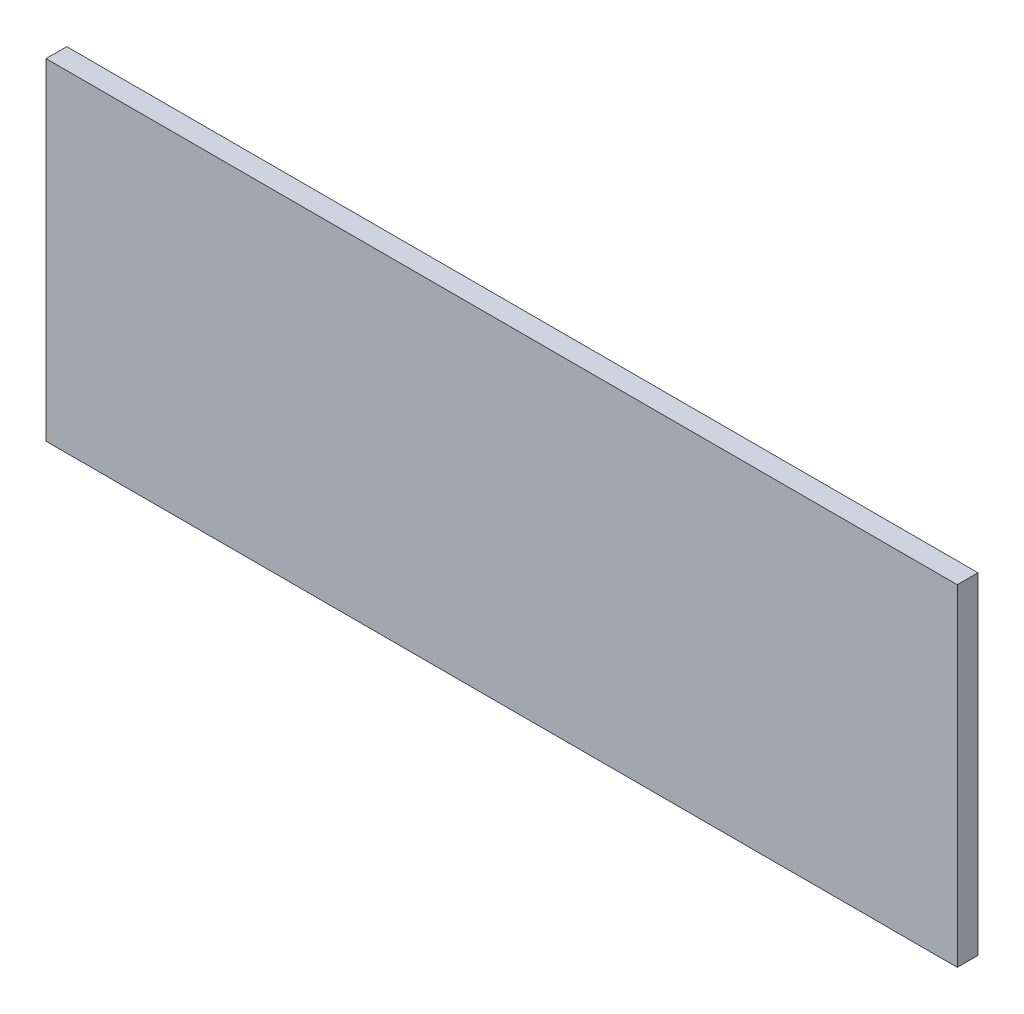
ISO-10303-21;
HEADER;
FILE_DESCRIPTION(('STEP AP214'),'2;1');
FILE_NAME('part.step','',(''),(''),'','','');
FILE_SCHEMA(('AUTOMOTIVE_DESIGN { 1 0 10303 214 1 1 1 1 }'));
ENDSEC;
DATA;
#1=APPLICATION_CONTEXT('core data for automotive mechanical design processes');
#2=APPLICATION_PROTOCOL_DEFINITION('international standard','automotive_design',2000,#1);
#3=PRODUCT_CONTEXT('',#1,'mechanical');
#4=PRODUCT('Part','Part','',(#3));
#5=PRODUCT_RELATED_PRODUCT_CATEGORY('part','',(#4));
#6=PRODUCT_DEFINITION_FORMATION('','',#4);
#7=PRODUCT_DEFINITION_CONTEXT('part definition',#1,'design');
#8=PRODUCT_DEFINITION('design','',#6,#7);
#9=PRODUCT_DEFINITION_SHAPE('','',#8);
#10=(LENGTH_UNIT() NAMED_UNIT(*) SI_UNIT(.MILLI.,.METRE.));
#11=(NAMED_UNIT(*) PLANE_ANGLE_UNIT() SI_UNIT($,.RADIAN.));
#12=(NAMED_UNIT(*) SI_UNIT($,.STERADIAN.) SOLID_ANGLE_UNIT());
#13=UNCERTAINTY_MEASURE_WITH_UNIT(LENGTH_MEASURE(1.E-05),#10,'distance_accuracy_value','');
#14=(GEOMETRIC_REPRESENTATION_CONTEXT(3) GLOBAL_UNCERTAINTY_ASSIGNED_CONTEXT((#13)) GLOBAL_UNIT_ASSIGNED_CONTEXT((#10,
#11,#12)) REPRESENTATION_CONTEXT('',''));
#15=CARTESIAN_POINT('',(0.,0.,0.));
#16=DIRECTION('',(0.,0.,1.));
#17=DIRECTION('',(1.,0.,0.));
#18=AXIS2_PLACEMENT_3D('',#15,#16,#17);
#19=CARTESIAN_POINT('',(69.85,-25.4,1.5875));
#20=DIRECTION('',(-1.,0.,0.));
#21=DIRECTION('',(0.,0.,1.));
#22=AXIS2_PLACEMENT_3D('',#19,#20,#21);
#23=PLANE('',#22);
#24=DIRECTION('',(0.,1.,0.));
#25=VECTOR('',#24,1.);
#26=CARTESIAN_POINT('',(69.85,-25.4,-1.5875));
#27=LINE('',#26,#25);
#28=CARTESIAN_POINT('',(69.85,-25.4,-1.5875));
#29=VERTEX_POINT('',#28);
#30=CARTESIAN_POINT('',(69.85,25.4,-1.5875));
#31=VERTEX_POINT('',#30);
#32=EDGE_CURVE('E107',#29,#31,#27,.T.);
#33=ORIENTED_EDGE('',*,*,#32,.T.);
#34=DIRECTION('',(0.,0.,-1.));
#35=VECTOR('',#34,1.);
#36=CARTESIAN_POINT('',(69.85,25.4,1.5875));
#37=LINE('',#36,#35);
#38=CARTESIAN_POINT('',(69.85,25.4,1.5875));
#39=VERTEX_POINT('',#38);
#40=EDGE_CURVE('E11',#39,#31,#37,.T.);
#41=ORIENTED_EDGE('',*,*,#40,.F.);
#42=DIRECTION('',(0.,1.,0.));
#43=VECTOR('',#42,1.);
#44=CARTESIAN_POINT('',(69.85,-25.4,1.5875));
#45=LINE('',#44,#43);
#46=CARTESIAN_POINT('',(69.85,-25.4,1.5875));
#47=VERTEX_POINT('',#46);
#48=EDGE_CURVE('E91',#47,#39,#45,.T.);
#49=ORIENTED_EDGE('',*,*,#48,.F.);
#50=DIRECTION('',(0.,0.,-1.));
#51=VECTOR('',#50,1.);
#52=CARTESIAN_POINT('',(69.85,-25.4,1.5875));
#53=LINE('',#52,#51);
#54=EDGE_CURVE('E103',#47,#29,#53,.T.);
#55=ORIENTED_EDGE('',*,*,#54,.T.);
#56=EDGE_LOOP('',(#33,#41,#49,#55));
#57=FACE_BOUND('',#56,.T.);
#58=ADVANCED_FACE('F39',(#57),#23,.F.);
#59=CARTESIAN_POINT('',(-69.85,25.4,1.5875));
#60=DIRECTION('',(0.,-1.,0.));
#61=DIRECTION('',(0.,0.,-1.));
#62=AXIS2_PLACEMENT_3D('',#59,#60,#61);
#63=PLANE('',#62);
#64=DIRECTION('',(-1.,0.,0.));
#65=VECTOR('',#64,1.);
#66=CARTESIAN_POINT('',(-69.85,25.4,-1.5875));
#67=LINE('',#66,#65);
#68=CARTESIAN_POINT('',(-69.85,25.4,-1.5875));
#69=VERTEX_POINT('',#68);
#70=EDGE_CURVE('E96',#31,#69,#67,.T.);
#71=ORIENTED_EDGE('',*,*,#70,.T.);
#72=DIRECTION('',(0.,0.,-1.));
#73=VECTOR('',#72,1.);
#74=CARTESIAN_POINT('',(-69.85,25.4,1.5875));
#75=LINE('',#74,#73);
#76=CARTESIAN_POINT('',(-69.85,25.4,1.5875));
#77=VERTEX_POINT('',#76);
#78=EDGE_CURVE('E48',#77,#69,#75,.T.);
#79=ORIENTED_EDGE('',*,*,#78,.F.);
#80=DIRECTION('',(-1.,0.,0.));
#81=VECTOR('',#80,1.);
#82=CARTESIAN_POINT('',(-69.85,25.4,1.5875));
#83=LINE('',#82,#81);
#84=EDGE_CURVE('E86',#39,#77,#83,.T.);
#85=ORIENTED_EDGE('',*,*,#84,.F.);
#86=ORIENTED_EDGE('',*,*,#40,.T.);
#87=EDGE_LOOP('',(#71,#79,#85,#86));
#88=FACE_BOUND('',#87,.T.);
#89=ADVANCED_FACE('F95',(#88),#63,.F.);
#90=CARTESIAN_POINT('',(-69.85,-25.4,1.5875));
#91=DIRECTION('',(1.,0.,0.));
#92=DIRECTION('',(0.,0.,-1.));
#93=AXIS2_PLACEMENT_3D('',#90,#91,#92);
#94=PLANE('',#93);
#95=DIRECTION('',(0.,-1.,0.));
#96=VECTOR('',#95,1.);
#97=CARTESIAN_POINT('',(-69.85,-25.4,-1.5875));
#98=LINE('',#97,#96);
#99=CARTESIAN_POINT('',(-69.85,-25.4,-1.5875));
#100=VERTEX_POINT('',#99);
#101=EDGE_CURVE('E73',#69,#100,#98,.T.);
#102=ORIENTED_EDGE('',*,*,#101,.T.);
#103=DIRECTION('',(0.,0.,-1.));
#104=VECTOR('',#103,1.);
#105=CARTESIAN_POINT('',(-69.85,-25.4,1.5875));
#106=LINE('',#105,#104);
#107=CARTESIAN_POINT('',(-69.85,-25.4,1.5875));
#108=VERTEX_POINT('',#107);
#109=EDGE_CURVE('E98',#108,#100,#106,.T.);
#110=ORIENTED_EDGE('',*,*,#109,.F.);
#111=DIRECTION('',(0.,-1.,0.));
#112=VECTOR('',#111,1.);
#113=CARTESIAN_POINT('',(-69.85,-25.4,1.5875));
#114=LINE('',#113,#112);
#115=EDGE_CURVE('E89',#77,#108,#114,.T.);
#116=ORIENTED_EDGE('',*,*,#115,.F.);
#117=ORIENTED_EDGE('',*,*,#78,.T.);
#118=EDGE_LOOP('',(#102,#110,#116,#117));
#119=FACE_BOUND('',#118,.T.);
#120=ADVANCED_FACE('F99',(#119),#94,.F.);
#121=CARTESIAN_POINT('',(-69.85,-25.4,1.5875));
#122=DIRECTION('',(0.,1.,0.));
#123=DIRECTION('',(0.,0.,1.));
#124=AXIS2_PLACEMENT_3D('',#121,#122,#123);
#125=PLANE('',#124);
#126=DIRECTION('',(1.,0.,0.));
#127=VECTOR('',#126,1.);
#128=CARTESIAN_POINT('',(-69.85,-25.4,-1.5875));
#129=LINE('',#128,#127);
#130=EDGE_CURVE('E79',#100,#29,#129,.T.);
#131=ORIENTED_EDGE('',*,*,#130,.T.);
#132=ORIENTED_EDGE('',*,*,#54,.F.);
#133=DIRECTION('',(1.,0.,0.));
#134=VECTOR('',#133,1.);
#135=CARTESIAN_POINT('',(-69.85,-25.4,1.5875));
#136=LINE('',#135,#134);
#137=EDGE_CURVE('E56',#108,#47,#136,.T.);
#138=ORIENTED_EDGE('',*,*,#137,.F.);
#139=ORIENTED_EDGE('',*,*,#109,.T.);
#140=EDGE_LOOP('',(#131,#132,#138,#139));
#141=FACE_BOUND('',#140,.T.);
#142=ADVANCED_FACE('F120',(#141),#125,.F.);
#143=CARTESIAN_POINT('',(0.,0.,1.5875));
#144=DIRECTION('',(0.,0.,-1.));
#145=DIRECTION('',(-1.,0.,0.));
#146=AXIS2_PLACEMENT_3D('',#143,#144,#145);
#147=PLANE('',#146);
#148=ORIENTED_EDGE('',*,*,#48,.T.);
#149=ORIENTED_EDGE('',*,*,#84,.T.);
#150=ORIENTED_EDGE('',*,*,#115,.T.);
#151=ORIENTED_EDGE('',*,*,#137,.T.);
#152=EDGE_LOOP('',(#148,#149,#150,#151));
#153=FACE_BOUND('',#152,.T.);
#154=ADVANCED_FACE('F87',(#153),#147,.F.);
#155=CARTESIAN_POINT('',(0.,0.,-1.5875));
#156=DIRECTION('',(0.,0.,-1.));
#157=DIRECTION('',(-1.,0.,0.));
#158=AXIS2_PLACEMENT_3D('',#155,#156,#157);
#159=PLANE('',#158);
#160=ORIENTED_EDGE('',*,*,#32,.F.);
#161=ORIENTED_EDGE('',*,*,#130,.F.);
#162=ORIENTED_EDGE('',*,*,#101,.F.);
#163=ORIENTED_EDGE('',*,*,#70,.F.);
#164=EDGE_LOOP('',(#160,#161,#162,#163));
#165=FACE_BOUND('',#164,.T.);
#166=ADVANCED_FACE('F123',(#165),#159,.T.);
#167=CLOSED_SHELL('',(#58,#89,#120,#142,#154,#166));
#168=MANIFOLD_SOLID_BREP('B2',#167);
#169=ADVANCED_BREP_SHAPE_REPRESENTATION('',(#18,#168),#14);
#170=SHAPE_DEFINITION_REPRESENTATION(#9,#169);
ENDSEC;
END-ISO-10303-21;
